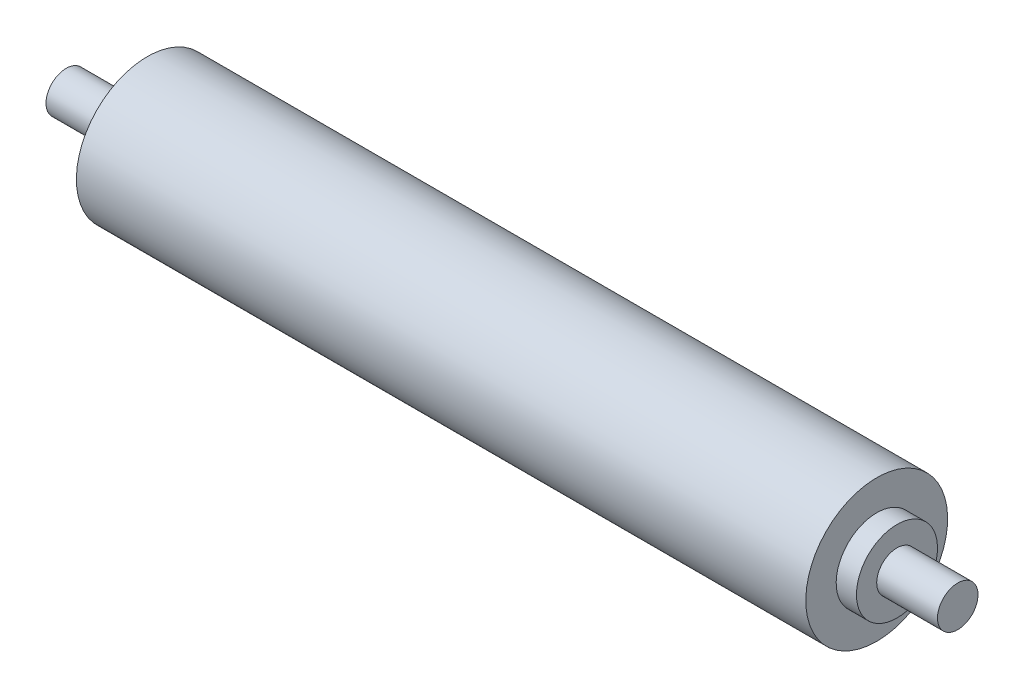
ISO-10303-21;
HEADER;
FILE_DESCRIPTION(('STEP AP214'),'2;1');
FILE_NAME('part.step','',(''),(''),'','','');
FILE_SCHEMA(('AUTOMOTIVE_DESIGN { 1 0 10303 214 1 1 1 1 }'));
ENDSEC;
DATA;
#1=APPLICATION_CONTEXT('core data for automotive mechanical design processes');
#2=APPLICATION_PROTOCOL_DEFINITION('international standard','automotive_design',2000,#1);
#3=PRODUCT_CONTEXT('',#1,'mechanical');
#4=PRODUCT('Part','Part','',(#3));
#5=PRODUCT_RELATED_PRODUCT_CATEGORY('part','',(#4));
#6=PRODUCT_DEFINITION_FORMATION('','',#4);
#7=PRODUCT_DEFINITION_CONTEXT('part definition',#1,'design');
#8=PRODUCT_DEFINITION('design','',#6,#7);
#9=PRODUCT_DEFINITION_SHAPE('','',#8);
#10=(LENGTH_UNIT() NAMED_UNIT(*) SI_UNIT(.MILLI.,.METRE.));
#11=(NAMED_UNIT(*) PLANE_ANGLE_UNIT() SI_UNIT($,.RADIAN.));
#12=(NAMED_UNIT(*) SI_UNIT($,.STERADIAN.) SOLID_ANGLE_UNIT());
#13=UNCERTAINTY_MEASURE_WITH_UNIT(LENGTH_MEASURE(1.E-05),#10,'distance_accuracy_value','');
#14=(GEOMETRIC_REPRESENTATION_CONTEXT(3) GLOBAL_UNCERTAINTY_ASSIGNED_CONTEXT((#13)) GLOBAL_UNIT_ASSIGNED_CONTEXT((#10,
#11,#12)) REPRESENTATION_CONTEXT('',''));
#15=CARTESIAN_POINT('',(0.,0.,0.));
#16=DIRECTION('',(0.,0.,1.));
#17=DIRECTION('',(1.,0.,0.));
#18=AXIS2_PLACEMENT_3D('',#15,#16,#17);
#19=CARTESIAN_POINT('',(-220.,0.,0.));
#20=DIRECTION('',(-1.,0.,0.));
#21=DIRECTION('',(0.,-1.,0.));
#22=AXIS2_PLACEMENT_3D('',#19,#20,#21);
#23=CYLINDRICAL_SURFACE('',#22,10.);
#24=CARTESIAN_POINT('',(190.,0.,0.));
#25=DIRECTION('',(-1.,0.,0.));
#26=DIRECTION('',(0.,-1.,0.));
#27=AXIS2_PLACEMENT_3D('',#24,#25,#26);
#28=CIRCLE('',#27,10.);
#29=CARTESIAN_POINT('',(190.,-9.99999999999995,0.));
#30=VERTEX_POINT('',#29);
#31=EDGE_CURVE('E80',#30,#30,#28,.T.);
#32=ORIENTED_EDGE('',*,*,#31,.F.);
#33=EDGE_LOOP('',(#32));
#34=FACE_BOUND('',#33,.T.);
#35=CARTESIAN_POINT('',(220.,0.,0.));
#36=DIRECTION('',(-1.,0.,0.));
#37=DIRECTION('',(0.,-1.,0.));
#38=AXIS2_PLACEMENT_3D('',#35,#36,#37);
#39=CIRCLE('',#38,10.);
#40=CARTESIAN_POINT('',(220.,-9.99999999999994,0.));
#41=VERTEX_POINT('',#40);
#42=EDGE_CURVE('E10',#41,#41,#39,.T.);
#43=ORIENTED_EDGE('',*,*,#42,.T.);
#44=EDGE_LOOP('',(#43));
#45=FACE_BOUND('',#44,.T.);
#46=ADVANCED_FACE('F37',(#34,#45),#23,.T.);
#47=CARTESIAN_POINT('',(220.,10.0000000000001,0.));
#48=DIRECTION('',(-1.,0.,0.));
#49=DIRECTION('',(0.,-1.,0.));
#50=AXIS2_PLACEMENT_3D('',#47,#48,#49);
#51=PLANE('',#50);
#52=ORIENTED_EDGE('',*,*,#42,.F.);
#53=EDGE_LOOP('',(#52));
#54=FACE_BOUND('',#53,.T.);
#55=ADVANCED_FACE('F88',(#54),#51,.F.);
#56=CARTESIAN_POINT('',(-220.,10.,0.));
#57=DIRECTION('',(1.,0.,0.));
#58=DIRECTION('',(0.,1.,0.));
#59=AXIS2_PLACEMENT_3D('',#56,#57,#58);
#60=PLANE('',#59);
#61=CARTESIAN_POINT('',(-220.,0.,0.));
#62=DIRECTION('',(-1.,0.,0.));
#63=DIRECTION('',(0.,-1.,0.));
#64=AXIS2_PLACEMENT_3D('',#61,#62,#63);
#65=CIRCLE('',#64,10.);
#66=CARTESIAN_POINT('',(-220.,-10.,0.));
#67=VERTEX_POINT('',#66);
#68=EDGE_CURVE('E44',#67,#67,#65,.T.);
#69=ORIENTED_EDGE('',*,*,#68,.T.);
#70=EDGE_LOOP('',(#69));
#71=FACE_BOUND('',#70,.T.);
#72=ADVANCED_FACE('F92',(#71),#60,.F.);
#73=CARTESIAN_POINT('',(-220.,0.,0.));
#74=DIRECTION('',(-1.,0.,0.));
#75=DIRECTION('',(0.,-1.,0.));
#76=AXIS2_PLACEMENT_3D('',#73,#74,#75);
#77=CYLINDRICAL_SURFACE('',#76,10.);
#78=ORIENTED_EDGE('',*,*,#68,.F.);
#79=EDGE_LOOP('',(#78));
#80=FACE_BOUND('',#79,.T.);
#81=CARTESIAN_POINT('',(-190.,0.,0.));
#82=DIRECTION('',(-1.,0.,0.));
#83=DIRECTION('',(0.,-1.,0.));
#84=AXIS2_PLACEMENT_3D('',#81,#82,#83);
#85=CIRCLE('',#84,10.);
#86=CARTESIAN_POINT('',(-190.,-9.99999999999999,0.));
#87=VERTEX_POINT('',#86);
#88=EDGE_CURVE('E49',#87,#87,#85,.T.);
#89=ORIENTED_EDGE('',*,*,#88,.T.);
#90=EDGE_LOOP('',(#89));
#91=FACE_BOUND('',#90,.T.);
#92=ADVANCED_FACE('F97',(#80,#91),#77,.T.);
#93=CARTESIAN_POINT('',(-190.,10.,0.));
#94=DIRECTION('',(1.,0.,0.));
#95=DIRECTION('',(0.,1.,0.));
#96=AXIS2_PLACEMENT_3D('',#93,#94,#95);
#97=PLANE('',#96);
#98=ORIENTED_EDGE('',*,*,#88,.F.);
#99=EDGE_LOOP('',(#98));
#100=FACE_BOUND('',#99,.T.);
#101=CARTESIAN_POINT('',(-190.,0.,0.));
#102=DIRECTION('',(-1.,0.,0.));
#103=DIRECTION('',(0.,-1.,0.));
#104=AXIS2_PLACEMENT_3D('',#101,#102,#103);
#105=CIRCLE('',#104,20.);
#106=CARTESIAN_POINT('',(-190.,-20.,0.));
#107=VERTEX_POINT('',#106);
#108=EDGE_CURVE('E54',#107,#107,#105,.T.);
#109=ORIENTED_EDGE('',*,*,#108,.T.);
#110=EDGE_LOOP('',(#109));
#111=FACE_BOUND('',#110,.T.);
#112=ADVANCED_FACE('F102',(#100,#111),#97,.F.);
#113=CARTESIAN_POINT('',(-220.,0.,0.));
#114=DIRECTION('',(-1.,0.,0.));
#115=DIRECTION('',(0.,-1.,0.));
#116=AXIS2_PLACEMENT_3D('',#113,#114,#115);
#117=CYLINDRICAL_SURFACE('',#116,20.);
#118=ORIENTED_EDGE('',*,*,#108,.F.);
#119=EDGE_LOOP('',(#118));
#120=FACE_BOUND('',#119,.T.);
#121=CARTESIAN_POINT('',(-180.,0.,0.));
#122=DIRECTION('',(-1.,0.,0.));
#123=DIRECTION('',(0.,-1.,0.));
#124=AXIS2_PLACEMENT_3D('',#121,#122,#123);
#125=CIRCLE('',#124,20.);
#126=CARTESIAN_POINT('',(-180.,-20.,0.));
#127=VERTEX_POINT('',#126);
#128=EDGE_CURVE('E60',#127,#127,#125,.T.);
#129=ORIENTED_EDGE('',*,*,#128,.T.);
#130=EDGE_LOOP('',(#129));
#131=FACE_BOUND('',#130,.T.);
#132=ADVANCED_FACE('F106',(#120,#131),#117,.T.);
#133=CARTESIAN_POINT('',(-180.,35.,0.));
#134=DIRECTION('',(1.,0.,0.));
#135=DIRECTION('',(0.,1.,0.));
#136=AXIS2_PLACEMENT_3D('',#133,#134,#135);
#137=PLANE('',#136);
#138=ORIENTED_EDGE('',*,*,#128,.F.);
#139=EDGE_LOOP('',(#138));
#140=FACE_BOUND('',#139,.T.);
#141=CARTESIAN_POINT('',(-180.,0.,0.));
#142=DIRECTION('',(-1.,0.,0.));
#143=DIRECTION('',(0.,-1.,0.));
#144=AXIS2_PLACEMENT_3D('',#141,#142,#143);
#145=CIRCLE('',#144,35.);
#146=CARTESIAN_POINT('',(-180.,-35.,0.));
#147=VERTEX_POINT('',#146);
#148=EDGE_CURVE('E64',#147,#147,#145,.T.);
#149=ORIENTED_EDGE('',*,*,#148,.T.);
#150=EDGE_LOOP('',(#149));
#151=FACE_BOUND('',#150,.T.);
#152=ADVANCED_FACE('F110',(#140,#151),#137,.F.);
#153=CARTESIAN_POINT('',(-220.,0.,0.));
#154=DIRECTION('',(-1.,0.,0.));
#155=DIRECTION('',(0.,-1.,0.));
#156=AXIS2_PLACEMENT_3D('',#153,#154,#155);
#157=CYLINDRICAL_SURFACE('',#156,35.);
#158=ORIENTED_EDGE('',*,*,#148,.F.);
#159=EDGE_LOOP('',(#158));
#160=FACE_BOUND('',#159,.T.);
#161=CARTESIAN_POINT('',(180.,0.,0.));
#162=DIRECTION('',(-1.,0.,0.));
#163=DIRECTION('',(0.,-1.,0.));
#164=AXIS2_PLACEMENT_3D('',#161,#162,#163);
#165=CIRCLE('',#164,35.);
#166=CARTESIAN_POINT('',(180.,-35.,0.));
#167=VERTEX_POINT('',#166);
#168=EDGE_CURVE('E68',#167,#167,#165,.T.);
#169=ORIENTED_EDGE('',*,*,#168,.T.);
#170=EDGE_LOOP('',(#169));
#171=FACE_BOUND('',#170,.T.);
#172=ADVANCED_FACE('F114',(#160,#171),#157,.T.);
#173=CARTESIAN_POINT('',(180.,35.,0.));
#174=DIRECTION('',(-1.,0.,0.));
#175=DIRECTION('',(0.,-1.,0.));
#176=AXIS2_PLACEMENT_3D('',#173,#174,#175);
#177=PLANE('',#176);
#178=ORIENTED_EDGE('',*,*,#168,.F.);
#179=EDGE_LOOP('',(#178));
#180=FACE_BOUND('',#179,.T.);
#181=CARTESIAN_POINT('',(180.,0.,0.));
#182=DIRECTION('',(-1.,0.,0.));
#183=DIRECTION('',(0.,-1.,0.));
#184=AXIS2_PLACEMENT_3D('',#181,#182,#183);
#185=CIRCLE('',#184,20.);
#186=CARTESIAN_POINT('',(180.,-19.9999999999999,0.));
#187=VERTEX_POINT('',#186);
#188=EDGE_CURVE('E72',#187,#187,#185,.T.);
#189=ORIENTED_EDGE('',*,*,#188,.T.);
#190=EDGE_LOOP('',(#189));
#191=FACE_BOUND('',#190,.T.);
#192=ADVANCED_FACE('F118',(#180,#191),#177,.F.);
#193=CARTESIAN_POINT('',(-220.,0.,0.));
#194=DIRECTION('',(-1.,0.,0.));
#195=DIRECTION('',(0.,-1.,0.));
#196=AXIS2_PLACEMENT_3D('',#193,#194,#195);
#197=CYLINDRICAL_SURFACE('',#196,20.);
#198=ORIENTED_EDGE('',*,*,#188,.F.);
#199=EDGE_LOOP('',(#198));
#200=FACE_BOUND('',#199,.T.);
#201=CARTESIAN_POINT('',(190.,0.,0.));
#202=DIRECTION('',(-1.,0.,0.));
#203=DIRECTION('',(0.,-1.,0.));
#204=AXIS2_PLACEMENT_3D('',#201,#202,#203);
#205=CIRCLE('',#204,20.);
#206=CARTESIAN_POINT('',(190.,-19.9999999999999,0.));
#207=VERTEX_POINT('',#206);
#208=EDGE_CURVE('E76',#207,#207,#205,.T.);
#209=ORIENTED_EDGE('',*,*,#208,.T.);
#210=EDGE_LOOP('',(#209));
#211=FACE_BOUND('',#210,.T.);
#212=ADVANCED_FACE('F122',(#200,#211),#197,.T.);
#213=CARTESIAN_POINT('',(190.,10.,0.));
#214=DIRECTION('',(-1.,0.,0.));
#215=DIRECTION('',(0.,-1.,0.));
#216=AXIS2_PLACEMENT_3D('',#213,#214,#215);
#217=PLANE('',#216);
#218=ORIENTED_EDGE('',*,*,#208,.F.);
#219=EDGE_LOOP('',(#218));
#220=FACE_BOUND('',#219,.T.);
#221=ORIENTED_EDGE('',*,*,#31,.T.);
#222=EDGE_LOOP('',(#221));
#223=FACE_BOUND('',#222,.T.);
#224=ADVANCED_FACE('F85',(#220,#223),#217,.F.);
#225=CLOSED_SHELL('',(#46,#55,#72,#92,#112,#132,#152,#172,#192,#212,#224));
#226=MANIFOLD_SOLID_BREP('B2',#225);
#227=ADVANCED_BREP_SHAPE_REPRESENTATION('',(#18,#226),#14);
#228=SHAPE_DEFINITION_REPRESENTATION(#9,#227);
ENDSEC;
END-ISO-10303-21;
